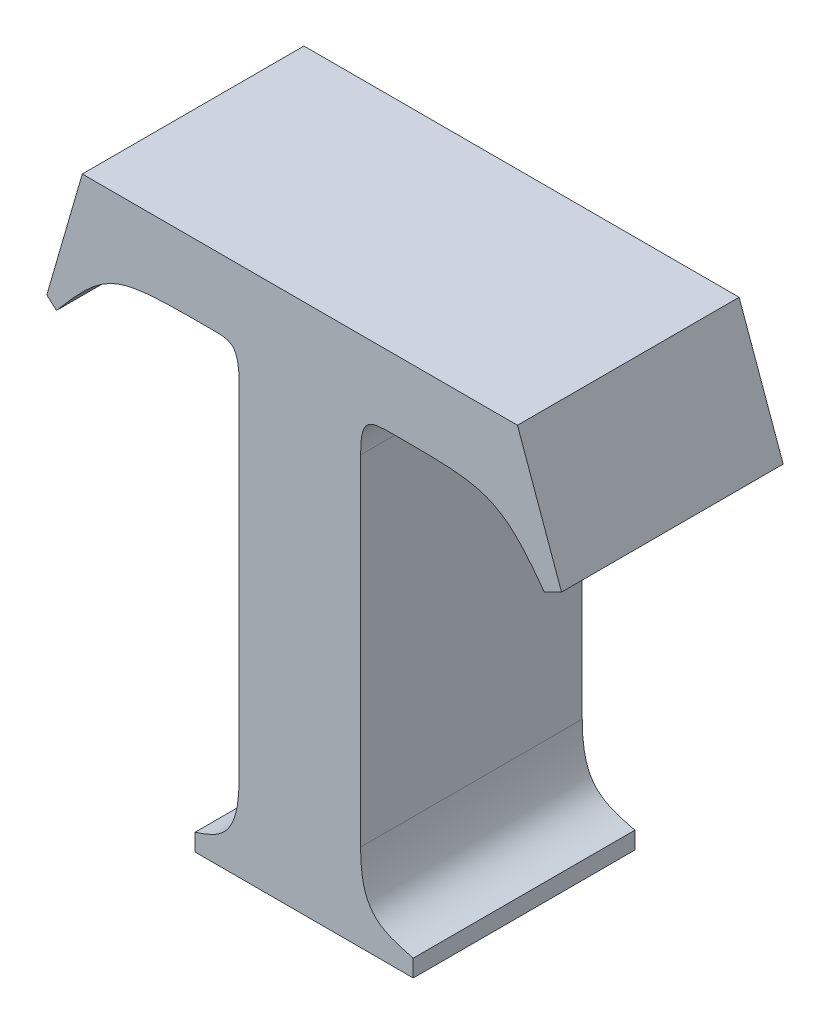
ISO-10303-21;
HEADER;
FILE_DESCRIPTION(('STEP AP214'),'2;1');
FILE_NAME('part.step','',(''),(''),'','','');
FILE_SCHEMA(('AUTOMOTIVE_DESIGN { 1 0 10303 214 1 1 1 1 }'));
ENDSEC;
DATA;
#1=APPLICATION_CONTEXT('core data for automotive mechanical design processes');
#2=APPLICATION_PROTOCOL_DEFINITION('international standard','automotive_design',2000,#1);
#3=PRODUCT_CONTEXT('',#1,'mechanical');
#4=PRODUCT('Part','Part','',(#3));
#5=PRODUCT_RELATED_PRODUCT_CATEGORY('part','',(#4));
#6=PRODUCT_DEFINITION_FORMATION('','',#4);
#7=PRODUCT_DEFINITION_CONTEXT('part definition',#1,'design');
#8=PRODUCT_DEFINITION('design','',#6,#7);
#9=PRODUCT_DEFINITION_SHAPE('','',#8);
#10=(LENGTH_UNIT() NAMED_UNIT(*) SI_UNIT(.MILLI.,.METRE.));
#11=(NAMED_UNIT(*) PLANE_ANGLE_UNIT() SI_UNIT($,.RADIAN.));
#12=(NAMED_UNIT(*) SI_UNIT($,.STERADIAN.) SOLID_ANGLE_UNIT());
#13=UNCERTAINTY_MEASURE_WITH_UNIT(LENGTH_MEASURE(1.E-05),#10,'distance_accuracy_value','');
#14=(GEOMETRIC_REPRESENTATION_CONTEXT(3) GLOBAL_UNCERTAINTY_ASSIGNED_CONTEXT((#13)) GLOBAL_UNIT_ASSIGNED_CONTEXT((#10,
#11,#12)) REPRESENTATION_CONTEXT('',''));
#15=CARTESIAN_POINT('',(0.,0.,0.));
#16=DIRECTION('',(0.,0.,1.));
#17=DIRECTION('',(1.,0.,0.));
#18=AXIS2_PLACEMENT_3D('',#15,#16,#17);
#19=CARTESIAN_POINT('',(4.4564512970043,-0.224083187566746,0.));
#20=CARTESIAN_POINT('',(4.4564512970043,-0.224083187566746,0.1));
#21=CARTESIAN_POINT('',(4.4957176924864,-0.224083187978514,0.));
#22=CARTESIAN_POINT('',(4.4957176924864,-0.224083187978514,0.1));
#23=CARTESIAN_POINT('',(4.5034738352268,-0.224083187862937,0.));
#24=CARTESIAN_POINT('',(4.5034738352268,-0.224083187862937,0.1));
#25=CARTESIAN_POINT('',(4.5233504151259,-0.251715261258299,0.));
#26=CARTESIAN_POINT('',(4.5233504151259,-0.251715261258299,0.1));
#27=B_SPLINE_SURFACE_WITH_KNOTS('',3,1,((#19,#20),(#21,#22),(#23,#24),(#25,#26)),.UNSPECIFIED.,
.F.,.F.,.F.,(4,4),(2,2),(-1.,0.),(0.,0.01),.UNSPECIFIED.);
#28=CARTESIAN_POINT('',(4.5233504151259,-0.251715261258299,0.));
#29=CARTESIAN_POINT('',(4.5034738352268,-0.224083187862937,0.));
#30=CARTESIAN_POINT('',(4.4957176924864,-0.224083187978514,0.));
#31=CARTESIAN_POINT('',(4.4564512970043,-0.224083187566746,0.));
#32=B_SPLINE_CURVE_WITH_KNOTS('',3,(#28,#29,#30,#31),.UNSPECIFIED.,.F.,.F.,(4,4),(0.,1.),.UNSPECIFIED.);
#33=CARTESIAN_POINT('',(4.5233504151259,-0.251715261258299,0.));
#34=VERTEX_POINT('',#33);
#35=CARTESIAN_POINT('',(4.4564512970043,-0.224083187566746,0.));
#36=VERTEX_POINT('',#35);
#37=EDGE_CURVE('E11',#34,#36,#32,.T.);
#38=DIRECTION('',(0.,0.,1.));
#39=VECTOR('',#38,1.);
#40=CARTESIAN_POINT('',(4.5233504151259,-0.251715261258299,0.));
#41=LINE('',#40,#39);
#42=CARTESIAN_POINT('',(4.5233504151259,-0.251715261258299,0.1));
#43=VERTEX_POINT('',#42);
#44=EDGE_CURVE('E28',#34,#43,#41,.T.);
#45=CARTESIAN_POINT('',(4.4564512970043,-0.224083187566746,0.1));
#46=CARTESIAN_POINT('',(4.4957176924864,-0.224083187978514,0.1));
#47=CARTESIAN_POINT('',(4.5034738352268,-0.224083187862937,0.1));
#48=CARTESIAN_POINT('',(4.5233504151259,-0.251715261258299,0.1));
#49=B_SPLINE_CURVE_WITH_KNOTS('',3,(#45,#46,#47,#48),.UNSPECIFIED.,.F.,.F.,(4,4),(-1.,0.),.UNSPECIFIED.);
#50=CARTESIAN_POINT('',(4.4564512970043,-0.224083187566746,0.1));
#51=VERTEX_POINT('',#50);
#52=EDGE_CURVE('E152',#51,#43,#49,.T.);
#53=DIRECTION('',(0.,0.,1.));
#54=VECTOR('',#53,1.);
#55=CARTESIAN_POINT('',(4.4564512970043,-0.224083187566746,0.));
#56=LINE('',#55,#54);
#57=EDGE_CURVE('E304',#36,#51,#56,.T.);
#58=ORIENTED_EDGE('',*,*,#37,.F.);
#59=ORIENTED_EDGE('',*,*,#44,.T.);
#60=ORIENTED_EDGE('',*,*,#52,.F.);
#61=ORIENTED_EDGE('',*,*,#57,.F.);
#62=EDGE_LOOP('',(#58,#59,#60,#61));
#63=FACE_BOUND('',#62,.T.);
#64=ADVANCED_FACE('F17',(#63),#27,.T.);
#65=CARTESIAN_POINT('',(4.440453689634,-0.23959597746735,0.));
#66=CARTESIAN_POINT('',(4.440453689634,-0.23959597746735,0.1));
#67=CARTESIAN_POINT('',(4.4404536896338,-0.224083187805134,0.));
#68=CARTESIAN_POINT('',(4.4404536896338,-0.224083187805134,0.1));
#69=CARTESIAN_POINT('',(4.4443323014532,-0.224083187747337,0.));
#70=CARTESIAN_POINT('',(4.4443323014532,-0.224083187747337,0.1));
#71=CARTESIAN_POINT('',(4.4564512970043,-0.224083187566746,0.));
#72=CARTESIAN_POINT('',(4.4564512970043,-0.224083187566746,0.1));
#73=B_SPLINE_SURFACE_WITH_KNOTS('',3,1,((#65,#66),(#67,#68),(#69,#70),(#71,#72)),.UNSPECIFIED.,
.F.,.F.,.F.,(4,4),(2,2),(-1.,0.),(0.,0.01),.UNSPECIFIED.);
#74=CARTESIAN_POINT('',(4.4564512970043,-0.224083187566746,0.));
#75=CARTESIAN_POINT('',(4.4443323014532,-0.224083187747337,0.));
#76=CARTESIAN_POINT('',(4.4404536896338,-0.224083187805134,0.));
#77=CARTESIAN_POINT('',(4.440453689634,-0.23959597746735,0.));
#78=B_SPLINE_CURVE_WITH_KNOTS('',3,(#74,#75,#76,#77),.UNSPECIFIED.,.F.,.F.,(4,4),(0.,1.),.UNSPECIFIED.);
#79=CARTESIAN_POINT('',(4.440453689634,-0.23959597746735,0.));
#80=VERTEX_POINT('',#79);
#81=EDGE_CURVE('E297',#36,#80,#78,.T.);
#82=CARTESIAN_POINT('',(4.440453689634,-0.23959597746735,0.1));
#83=CARTESIAN_POINT('',(4.4404536896338,-0.224083187805134,0.1));
#84=CARTESIAN_POINT('',(4.4443323014532,-0.224083187747337,0.1));
#85=CARTESIAN_POINT('',(4.4564512970043,-0.224083187566746,0.1));
#86=B_SPLINE_CURVE_WITH_KNOTS('',3,(#82,#83,#84,#85),.UNSPECIFIED.,.F.,.F.,(4,4),(-1.,0.),.UNSPECIFIED.);
#87=CARTESIAN_POINT('',(4.440453689634,-0.23959597746735,0.1));
#88=VERTEX_POINT('',#87);
#89=EDGE_CURVE('E293',#88,#51,#86,.T.);
#90=DIRECTION('',(0.,0.,1.));
#91=VECTOR('',#90,1.);
#92=CARTESIAN_POINT('',(4.440453689634,-0.23959597746735,0.));
#93=LINE('',#92,#91);
#94=EDGE_CURVE('E290',#80,#88,#93,.T.);
#95=ORIENTED_EDGE('',*,*,#81,.F.);
#96=ORIENTED_EDGE('',*,*,#57,.T.);
#97=ORIENTED_EDGE('',*,*,#89,.F.);
#98=ORIENTED_EDGE('',*,*,#94,.F.);
#99=EDGE_LOOP('',(#95,#96,#97,#98));
#100=FACE_BOUND('',#99,.T.);
#101=ADVANCED_FACE('F366',(#100),#73,.T.);
#102=CARTESIAN_POINT('',(4.440453689634,-0.392784138206144,0.));
#103=DIRECTION('',(1.,0.,0.));
#104=DIRECTION('',(0.,1.,0.));
#105=AXIS2_PLACEMENT_3D('',#102,#103,#104);
#106=PLANE('',#105);
#107=DIRECTION('',(0.,-1.,0.));
#108=VECTOR('',#107,1.);
#109=CARTESIAN_POINT('',(4.440453689634,-0.23959597746735,0.));
#110=LINE('',#109,#108);
#111=CARTESIAN_POINT('',(4.440453689634,-0.392784138206144,0.));
#112=VERTEX_POINT('',#111);
#113=EDGE_CURVE('E288',#80,#112,#110,.T.);
#114=ORIENTED_EDGE('',*,*,#113,.F.);
#115=ORIENTED_EDGE('',*,*,#94,.T.);
#116=DIRECTION('',(0.,1.,0.));
#117=VECTOR('',#116,1.);
#118=CARTESIAN_POINT('',(4.440453689634,-0.23959597746735,0.1));
#119=LINE('',#118,#117);
#120=CARTESIAN_POINT('',(4.440453689634,-0.392784138206144,0.1));
#121=VERTEX_POINT('',#120);
#122=EDGE_CURVE('E285',#121,#88,#119,.T.);
#123=ORIENTED_EDGE('',*,*,#122,.F.);
#124=DIRECTION('',(0.,0.,1.));
#125=VECTOR('',#124,1.);
#126=CARTESIAN_POINT('',(4.440453689634,-0.392784138206144,0.));
#127=LINE('',#126,#125);
#128=EDGE_CURVE('E279',#112,#121,#127,.T.);
#129=ORIENTED_EDGE('',*,*,#128,.F.);
#130=EDGE_LOOP('',(#114,#115,#123,#129));
#131=FACE_BOUND('',#130,.T.);
#132=ADVANCED_FACE('F362',(#131),#106,.T.);
#133=CARTESIAN_POINT('',(4.464207439746,-0.424294319298148,0.));
#134=CARTESIAN_POINT('',(4.464207439746,-0.424294319298148,0.1));
#135=CARTESIAN_POINT('',(4.4482098333695,-0.420416067498823,0.));
#136=CARTESIAN_POINT('',(4.4482098333695,-0.420416067498823,0.1));
#137=CARTESIAN_POINT('',(4.4404536904882,-0.416537924348319,0.));
#138=CARTESIAN_POINT('',(4.4404536904882,-0.416537924348319,0.1));
#139=CARTESIAN_POINT('',(4.440453689634,-0.392784138206144,0.));
#140=CARTESIAN_POINT('',(4.440453689634,-0.392784138206144,0.1));
#141=B_SPLINE_SURFACE_WITH_KNOTS('',3,1,((#133,#134),(#135,#136),(#137,#138),(#139,#140)),
.UNSPECIFIED.,.F.,.F.,.F.,(4,4),(2,2),(-1.,0.),(0.,0.01),.UNSPECIFIED.);
#142=CARTESIAN_POINT('',(4.440453689634,-0.392784138206144,0.));
#143=CARTESIAN_POINT('',(4.4404536904882,-0.416537924348319,0.));
#144=CARTESIAN_POINT('',(4.4482098333695,-0.420416067498823,0.));
#145=CARTESIAN_POINT('',(4.464207439746,-0.424294319298148,0.));
#146=B_SPLINE_CURVE_WITH_KNOTS('',3,(#142,#143,#144,#145),.UNSPECIFIED.,.F.,.F.,(4,4),(0.,1.),.UNSPECIFIED.);
#147=CARTESIAN_POINT('',(4.464207439746,-0.424294319298148,0.));
#148=VERTEX_POINT('',#147);
#149=EDGE_CURVE('E272',#112,#148,#146,.T.);
#150=CARTESIAN_POINT('',(4.464207439746,-0.424294319298148,0.1));
#151=CARTESIAN_POINT('',(4.4482098333695,-0.420416067498823,0.1));
#152=CARTESIAN_POINT('',(4.4404536904882,-0.416537924348319,0.1));
#153=CARTESIAN_POINT('',(4.440453689634,-0.392784138206144,0.1));
#154=B_SPLINE_CURVE_WITH_KNOTS('',3,(#150,#151,#152,#153),.UNSPECIFIED.,.F.,.F.,(4,4),(-1.,0.),.UNSPECIFIED.);
#155=CARTESIAN_POINT('',(4.464207439746,-0.424294319298148,0.1));
#156=VERTEX_POINT('',#155);
#157=EDGE_CURVE('E267',#156,#121,#154,.T.);
#158=DIRECTION('',(0.,0.,1.));
#159=VECTOR('',#158,1.);
#160=CARTESIAN_POINT('',(4.464207439746,-0.424294319298148,0.));
#161=LINE('',#160,#159);
#162=EDGE_CURVE('E264',#148,#156,#161,.T.);
#163=ORIENTED_EDGE('',*,*,#149,.F.);
#164=ORIENTED_EDGE('',*,*,#128,.T.);
#165=ORIENTED_EDGE('',*,*,#157,.F.);
#166=ORIENTED_EDGE('',*,*,#162,.F.);
#167=EDGE_LOOP('',(#163,#164,#165,#166));
#168=FACE_BOUND('',#167,.T.);
#169=ADVANCED_FACE('F358',(#168),#141,.T.);
#170=CARTESIAN_POINT('',(4.464207439746,-0.432050714249068,0.));
#171=DIRECTION('',(1.,0.,0.));
#172=DIRECTION('',(0.,1.,0.));
#173=AXIS2_PLACEMENT_3D('',#170,#171,#172);
#174=PLANE('',#173);
#175=DIRECTION('',(0.,-1.,0.));
#176=VECTOR('',#175,1.);
#177=CARTESIAN_POINT('',(4.464207439746,-0.424294319298148,0.));
#178=LINE('',#177,#176);
#179=CARTESIAN_POINT('',(4.464207439746,-0.432050714249068,0.));
#180=VERTEX_POINT('',#179);
#181=EDGE_CURVE('E262',#148,#180,#178,.T.);
#182=ORIENTED_EDGE('',*,*,#181,.F.);
#183=ORIENTED_EDGE('',*,*,#162,.T.);
#184=DIRECTION('',(0.,1.,0.));
#185=VECTOR('',#184,1.);
#186=CARTESIAN_POINT('',(4.464207439746,-0.424294319298148,0.1));
#187=LINE('',#186,#185);
#188=CARTESIAN_POINT('',(4.464207439746,-0.432050714249068,0.1));
#189=VERTEX_POINT('',#188);
#190=EDGE_CURVE('E259',#189,#156,#187,.T.);
#191=ORIENTED_EDGE('',*,*,#190,.F.);
#192=DIRECTION('',(0.,0.,1.));
#193=VECTOR('',#192,1.);
#194=CARTESIAN_POINT('',(4.464207439746,-0.432050714249068,0.));
#195=LINE('',#194,#193);
#196=EDGE_CURVE('E256',#180,#189,#195,.T.);
#197=ORIENTED_EDGE('',*,*,#196,.F.);
#198=EDGE_LOOP('',(#182,#183,#191,#197));
#199=FACE_BOUND('',#198,.T.);
#200=ADVANCED_FACE('F354',(#199),#174,.T.);
#201=CARTESIAN_POINT('',(4.3657995096659,-0.432050714249068,0.));
#202=DIRECTION('',(0.,-1.,0.));
#203=DIRECTION('',(1.,0.,0.));
#204=AXIS2_PLACEMENT_3D('',#201,#202,#203);
#205=PLANE('',#204);
#206=DIRECTION('',(-1.,0.,0.));
#207=VECTOR('',#206,1.);
#208=CARTESIAN_POINT('',(4.464207439746,-0.432050714249068,0.));
#209=LINE('',#208,#207);
#210=CARTESIAN_POINT('',(4.3657995096659,-0.432050714249068,0.));
#211=VERTEX_POINT('',#210);
#212=EDGE_CURVE('E254',#180,#211,#209,.T.);
#213=ORIENTED_EDGE('',*,*,#212,.F.);
#214=ORIENTED_EDGE('',*,*,#196,.T.);
#215=DIRECTION('',(1.,0.,0.));
#216=VECTOR('',#215,1.);
#217=CARTESIAN_POINT('',(4.464207439746,-0.432050714249068,0.1));
#218=LINE('',#217,#216);
#219=CARTESIAN_POINT('',(4.3657995096659,-0.432050714249068,0.1));
#220=VERTEX_POINT('',#219);
#221=EDGE_CURVE('E251',#220,#189,#218,.T.);
#222=ORIENTED_EDGE('',*,*,#221,.F.);
#223=DIRECTION('',(0.,0.,1.));
#224=VECTOR('',#223,1.);
#225=CARTESIAN_POINT('',(4.3657995096659,-0.432050714249068,0.));
#226=LINE('',#225,#224);
#227=EDGE_CURVE('E248',#211,#220,#226,.T.);
#228=ORIENTED_EDGE('',*,*,#227,.F.);
#229=EDGE_LOOP('',(#213,#214,#222,#228));
#230=FACE_BOUND('',#229,.T.);
#231=ADVANCED_FACE('F350',(#230),#205,.T.);
#232=CARTESIAN_POINT('',(4.3657995096659,-0.424294319298148,0.));
#233=DIRECTION('',(-1.,0.,0.));
#234=DIRECTION('',(0.,-1.,0.));
#235=AXIS2_PLACEMENT_3D('',#232,#233,#234);
#236=PLANE('',#235);
#237=DIRECTION('',(0.,1.,0.));
#238=VECTOR('',#237,1.);
#239=CARTESIAN_POINT('',(4.3657995096659,-0.432050714249068,0.));
#240=LINE('',#239,#238);
#241=CARTESIAN_POINT('',(4.3657995096659,-0.424294319298148,0.));
#242=VERTEX_POINT('',#241);
#243=EDGE_CURVE('E246',#211,#242,#240,.T.);
#244=ORIENTED_EDGE('',*,*,#243,.F.);
#245=ORIENTED_EDGE('',*,*,#227,.T.);
#246=DIRECTION('',(0.,-1.,0.));
#247=VECTOR('',#246,1.);
#248=CARTESIAN_POINT('',(4.3657995096659,-0.432050714249068,0.1));
#249=LINE('',#248,#247);
#250=CARTESIAN_POINT('',(4.3657995096659,-0.424294319298148,0.1));
#251=VERTEX_POINT('',#250);
#252=EDGE_CURVE('E243',#251,#220,#249,.T.);
#253=ORIENTED_EDGE('',*,*,#252,.F.);
#254=DIRECTION('',(0.,0.,1.));
#255=VECTOR('',#254,1.);
#256=CARTESIAN_POINT('',(4.3657995096659,-0.424294319298148,0.));
#257=LINE('',#256,#255);
#258=EDGE_CURVE('E237',#242,#251,#257,.T.);
#259=ORIENTED_EDGE('',*,*,#258,.F.);
#260=EDGE_LOOP('',(#244,#245,#253,#259));
#261=FACE_BOUND('',#260,.T.);
#262=ADVANCED_FACE('F346',(#261),#236,.T.);
#263=CARTESIAN_POINT('',(4.3856746479601,-0.392784138206144,0.));
#264=CARTESIAN_POINT('',(4.3856746479601,-0.392784138206144,0.1));
#265=CARTESIAN_POINT('',(4.3856746477971,-0.416537923929483,0.));
#266=CARTESIAN_POINT('',(4.3856746477971,-0.416537923929483,0.1));
#267=CARTESIAN_POINT('',(4.3779185051364,-0.420416067522484,0.));
#268=CARTESIAN_POINT('',(4.3779185051364,-0.420416067522484,0.1));
#269=CARTESIAN_POINT('',(4.3657995096659,-0.424294319298148,0.));
#270=CARTESIAN_POINT('',(4.3657995096659,-0.424294319298148,0.1));
#271=B_SPLINE_SURFACE_WITH_KNOTS('',3,1,((#263,#264),(#265,#266),(#267,#268),(#269,#270)),
.UNSPECIFIED.,.F.,.F.,.F.,(4,4),(2,2),(-1.,0.),(0.,0.01),.UNSPECIFIED.);
#272=CARTESIAN_POINT('',(4.3657995096659,-0.424294319298148,0.));
#273=CARTESIAN_POINT('',(4.3779185051364,-0.420416067522484,0.));
#274=CARTESIAN_POINT('',(4.3856746477971,-0.416537923929483,0.));
#275=CARTESIAN_POINT('',(4.3856746479601,-0.392784138206144,0.));
#276=B_SPLINE_CURVE_WITH_KNOTS('',3,(#272,#273,#274,#275),.UNSPECIFIED.,.F.,.F.,(4,4),(0.,1.),.UNSPECIFIED.);
#277=CARTESIAN_POINT('',(4.3856746479601,-0.392784138206144,0.));
#278=VERTEX_POINT('',#277);
#279=EDGE_CURVE('E230',#242,#278,#276,.T.);
#280=CARTESIAN_POINT('',(4.3856746479601,-0.392784138206144,0.1));
#281=CARTESIAN_POINT('',(4.3856746477971,-0.416537923929483,0.1));
#282=CARTESIAN_POINT('',(4.3779185051364,-0.420416067522484,0.1));
#283=CARTESIAN_POINT('',(4.3657995096659,-0.424294319298148,0.1));
#284=B_SPLINE_CURVE_WITH_KNOTS('',3,(#280,#281,#282,#283),.UNSPECIFIED.,.F.,.F.,(4,4),(-1.,0.),.UNSPECIFIED.);
#285=CARTESIAN_POINT('',(4.3856746479601,-0.392784138206144,0.1));
#286=VERTEX_POINT('',#285);
#287=EDGE_CURVE('E225',#286,#251,#284,.T.);
#288=DIRECTION('',(0.,0.,1.));
#289=VECTOR('',#288,1.);
#290=CARTESIAN_POINT('',(4.3856746479601,-0.392784138206144,0.));
#291=LINE('',#290,#289);
#292=EDGE_CURVE('E222',#278,#286,#291,.T.);
#293=ORIENTED_EDGE('',*,*,#279,.F.);
#294=ORIENTED_EDGE('',*,*,#258,.T.);
#295=ORIENTED_EDGE('',*,*,#287,.F.);
#296=ORIENTED_EDGE('',*,*,#292,.F.);
#297=EDGE_LOOP('',(#293,#294,#295,#296));
#298=FACE_BOUND('',#297,.T.);
#299=ADVANCED_FACE('F342',(#298),#271,.T.);
#300=CARTESIAN_POINT('',(4.3856746479601,-0.23959597746735,0.));
#301=DIRECTION('',(-1.,0.,0.));
#302=DIRECTION('',(0.,-1.,0.));
#303=AXIS2_PLACEMENT_3D('',#300,#301,#302);
#304=PLANE('',#303);
#305=DIRECTION('',(0.,1.,0.));
#306=VECTOR('',#305,1.);
#307=CARTESIAN_POINT('',(4.3856746479601,-0.392784138206144,0.));
#308=LINE('',#307,#306);
#309=CARTESIAN_POINT('',(4.3856746479601,-0.23959597746735,0.));
#310=VERTEX_POINT('',#309);
#311=EDGE_CURVE('E220',#278,#310,#308,.T.);
#312=ORIENTED_EDGE('',*,*,#311,.F.);
#313=ORIENTED_EDGE('',*,*,#292,.T.);
#314=DIRECTION('',(0.,-1.,0.));
#315=VECTOR('',#314,1.);
#316=CARTESIAN_POINT('',(4.3856746479601,-0.392784138206144,0.1));
#317=LINE('',#316,#315);
#318=CARTESIAN_POINT('',(4.3856746479601,-0.23959597746735,0.1));
#319=VERTEX_POINT('',#318);
#320=EDGE_CURVE('E217',#319,#286,#317,.T.);
#321=ORIENTED_EDGE('',*,*,#320,.F.);
#322=DIRECTION('',(0.,0.,1.));
#323=VECTOR('',#322,1.);
#324=CARTESIAN_POINT('',(4.3856746479601,-0.23959597746735,0.));
#325=LINE('',#324,#323);
#326=EDGE_CURVE('E211',#310,#319,#325,.T.);
#327=ORIENTED_EDGE('',*,*,#326,.F.);
#328=EDGE_LOOP('',(#312,#313,#321,#327));
#329=FACE_BOUND('',#328,.T.);
#330=ADVANCED_FACE('F338',(#329),#304,.T.);
#331=CARTESIAN_POINT('',(4.3735556524076,-0.224083187566746,0.));
#332=CARTESIAN_POINT('',(4.3735556524076,-0.224083187566746,0.1));
#333=CARTESIAN_POINT('',(4.3817971171316,-0.224083187542844,0.));
#334=CARTESIAN_POINT('',(4.3817971171316,-0.224083187542844,0.1));
#335=CARTESIAN_POINT('',(4.3856746480555,-0.224083187566758,0.));
#336=CARTESIAN_POINT('',(4.3856746480555,-0.224083187566758,0.1));
#337=CARTESIAN_POINT('',(4.3856746479601,-0.23959597746735,0.));
#338=CARTESIAN_POINT('',(4.3856746479601,-0.23959597746735,0.1));
#339=B_SPLINE_SURFACE_WITH_KNOTS('',3,1,((#331,#332),(#333,#334),(#335,#336),(#337,#338)),
.UNSPECIFIED.,.F.,.F.,.F.,(4,4),(2,2),(-1.,0.),(0.,0.01),.UNSPECIFIED.);
#340=CARTESIAN_POINT('',(4.3856746479601,-0.23959597746735,0.));
#341=CARTESIAN_POINT('',(4.3856746480555,-0.224083187566758,0.));
#342=CARTESIAN_POINT('',(4.3817971171316,-0.224083187542844,0.));
#343=CARTESIAN_POINT('',(4.3735556524076,-0.224083187566746,0.));
#344=B_SPLINE_CURVE_WITH_KNOTS('',3,(#340,#341,#342,#343),.UNSPECIFIED.,.F.,.F.,(4,4),(0.,1.),.UNSPECIFIED.);
#345=CARTESIAN_POINT('',(4.3735556524076,-0.224083187566746,0.));
#346=VERTEX_POINT('',#345);
#347=EDGE_CURVE('E204',#310,#346,#344,.T.);
#348=CARTESIAN_POINT('',(4.3735556524076,-0.224083187566746,0.1));
#349=CARTESIAN_POINT('',(4.3817971171316,-0.224083187542844,0.1));
#350=CARTESIAN_POINT('',(4.3856746480555,-0.224083187566758,0.1));
#351=CARTESIAN_POINT('',(4.3856746479601,-0.23959597746735,0.1));
#352=B_SPLINE_CURVE_WITH_KNOTS('',3,(#348,#349,#350,#351),.UNSPECIFIED.,.F.,.F.,(4,4),(-1.,0.),.UNSPECIFIED.);
#353=CARTESIAN_POINT('',(4.3735556524076,-0.224083187566746,0.1));
#354=VERTEX_POINT('',#353);
#355=EDGE_CURVE('E199',#354,#319,#352,.T.);
#356=DIRECTION('',(0.,0.,1.));
#357=VECTOR('',#356,1.);
#358=CARTESIAN_POINT('',(4.3735556524076,-0.224083187566746,0.));
#359=LINE('',#358,#357);
#360=EDGE_CURVE('E193',#346,#354,#359,.T.);
#361=ORIENTED_EDGE('',*,*,#347,.F.);
#362=ORIENTED_EDGE('',*,*,#326,.T.);
#363=ORIENTED_EDGE('',*,*,#355,.F.);
#364=ORIENTED_EDGE('',*,*,#360,.F.);
#365=EDGE_LOOP('',(#361,#362,#363,#364));
#366=FACE_BOUND('',#365,.T.);
#367=ADVANCED_FACE('F334',(#366),#339,.T.);
#368=CARTESIAN_POINT('',(4.3032628840575,-0.251715261258299,0.));
#369=CARTESIAN_POINT('',(4.3032628840575,-0.251715261258299,0.1));
#370=CARTESIAN_POINT('',(4.326533113773,-0.22408318954861,0.));
#371=CARTESIAN_POINT('',(4.326533113773,-0.22408318954861,0.1));
#372=CARTESIAN_POINT('',(4.3304106446969,-0.224083189385182,0.));
#373=CARTESIAN_POINT('',(4.3304106446969,-0.224083189385182,0.1));
#374=CARTESIAN_POINT('',(4.3735556524076,-0.224083187566746,0.));
#375=CARTESIAN_POINT('',(4.3735556524076,-0.224083187566746,0.1));
#376=B_SPLINE_SURFACE_WITH_KNOTS('',3,1,((#368,#369),(#370,#371),(#372,#373),(#374,#375)),
.UNSPECIFIED.,.F.,.F.,.F.,(4,4),(2,2),(-1.,0.),(0.,0.01),.UNSPECIFIED.);
#377=CARTESIAN_POINT('',(4.3735556524076,-0.224083187566746,0.));
#378=CARTESIAN_POINT('',(4.3304106446969,-0.224083189385182,0.));
#379=CARTESIAN_POINT('',(4.326533113773,-0.22408318954861,0.));
#380=CARTESIAN_POINT('',(4.3032628840575,-0.251715261258299,0.));
#381=B_SPLINE_CURVE_WITH_KNOTS('',3,(#377,#378,#379,#380),.UNSPECIFIED.,.F.,.F.,(4,4),(0.,1.),.UNSPECIFIED.);
#382=CARTESIAN_POINT('',(4.3032628840575,-0.251715261258299,0.));
#383=VERTEX_POINT('',#382);
#384=EDGE_CURVE('E186',#346,#383,#381,.T.);
#385=CARTESIAN_POINT('',(4.3032628840575,-0.251715261258299,0.1));
#386=CARTESIAN_POINT('',(4.326533113773,-0.22408318954861,0.1));
#387=CARTESIAN_POINT('',(4.3304106446969,-0.224083189385182,0.1));
#388=CARTESIAN_POINT('',(4.3735556524076,-0.224083187566746,0.1));
#389=B_SPLINE_CURVE_WITH_KNOTS('',3,(#385,#386,#387,#388),.UNSPECIFIED.,.F.,.F.,(4,4),(-1.,0.),.UNSPECIFIED.);
#390=CARTESIAN_POINT('',(4.3032628840575,-0.251715261258299,0.1));
#391=VERTEX_POINT('',#390);
#392=EDGE_CURVE('E181',#391,#354,#389,.T.);
#393=DIRECTION('',(0.,0.,1.));
#394=VECTOR('',#393,1.);
#395=CARTESIAN_POINT('',(4.3032628840575,-0.251715261258299,0.));
#396=LINE('',#395,#394);
#397=EDGE_CURVE('E178',#383,#391,#396,.T.);
#398=ORIENTED_EDGE('',*,*,#384,.F.);
#399=ORIENTED_EDGE('',*,*,#360,.T.);
#400=ORIENTED_EDGE('',*,*,#392,.F.);
#401=ORIENTED_EDGE('',*,*,#397,.F.);
#402=EDGE_LOOP('',(#398,#399,#400,#401));
#403=FACE_BOUND('',#402,.T.);
#404=ADVANCED_FACE('F330',(#403),#376,.T.);
#405=CARTESIAN_POINT('',(4.2989003915443,-0.247837117827599,0.));
#406=DIRECTION('',(-0.664399468795114,-0.747377646083137,0.));
#407=DIRECTION('',(0.747377646083137,-0.664399468795114,0.));
#408=AXIS2_PLACEMENT_3D('',#405,#406,#407);
#409=PLANE('',#408);
#410=DIRECTION('',(-0.747377646083137,0.664399468795114,0.));
#411=VECTOR('',#410,1.);
#412=CARTESIAN_POINT('',(4.3032628840575,-0.251715261258299,0.));
#413=LINE('',#412,#411);
#414=CARTESIAN_POINT('',(4.2989003915443,-0.247837117827599,0.));
#415=VERTEX_POINT('',#414);
#416=EDGE_CURVE('E176',#383,#415,#413,.T.);
#417=ORIENTED_EDGE('',*,*,#416,.F.);
#418=ORIENTED_EDGE('',*,*,#397,.T.);
#419=DIRECTION('',(0.747377646083137,-0.664399468795114,0.));
#420=VECTOR('',#419,1.);
#421=CARTESIAN_POINT('',(4.3032628840575,-0.251715261258299,0.1));
#422=LINE('',#421,#420);
#423=CARTESIAN_POINT('',(4.2989003915443,-0.247837117827599,0.1));
#424=VERTEX_POINT('',#423);
#425=EDGE_CURVE('E173',#424,#391,#422,.T.);
#426=ORIENTED_EDGE('',*,*,#425,.F.);
#427=DIRECTION('',(0.,0.,1.));
#428=VECTOR('',#427,1.);
#429=CARTESIAN_POINT('',(4.2989003915443,-0.247837117827599,0.));
#430=LINE('',#429,#428);
#431=EDGE_CURVE('E170',#415,#424,#430,.T.);
#432=ORIENTED_EDGE('',*,*,#431,.F.);
#433=EDGE_LOOP('',(#417,#418,#426,#432));
#434=FACE_BOUND('',#433,.T.);
#435=ADVANCED_FACE('F326',(#434),#409,.T.);
#436=CARTESIAN_POINT('',(4.3148979989147,-0.19257300647474,0.));
#437=DIRECTION('',(-0.960563793427833,0.27805970358096,0.));
#438=DIRECTION('',(-0.27805970358096,-0.960563793427833,0.));
#439=AXIS2_PLACEMENT_3D('',#436,#437,#438);
#440=PLANE('',#439);
#441=DIRECTION('',(0.27805970358096,0.960563793427833,0.));
#442=VECTOR('',#441,1.);
#443=CARTESIAN_POINT('',(4.2989003915443,-0.247837117827599,0.));
#444=LINE('',#443,#442);
#445=CARTESIAN_POINT('',(4.3148979989147,-0.19257300647474,0.));
#446=VERTEX_POINT('',#445);
#447=EDGE_CURVE('E168',#415,#446,#444,.T.);
#448=ORIENTED_EDGE('',*,*,#447,.F.);
#449=ORIENTED_EDGE('',*,*,#431,.T.);
#450=DIRECTION('',(-0.27805970358096,-0.960563793427833,0.));
#451=VECTOR('',#450,1.);
#452=CARTESIAN_POINT('',(4.2989003915443,-0.247837117827599,0.1));
#453=LINE('',#452,#451);
#454=CARTESIAN_POINT('',(4.3148979989147,-0.19257300647474,0.1));
#455=VERTEX_POINT('',#454);
#456=EDGE_CURVE('E165',#455,#424,#453,.T.);
#457=ORIENTED_EDGE('',*,*,#456,.F.);
#458=DIRECTION('',(0.,0.,1.));
#459=VECTOR('',#458,1.);
#460=CARTESIAN_POINT('',(4.3148979989147,-0.19257300647474,0.));
#461=LINE('',#460,#459);
#462=EDGE_CURVE('E162',#446,#455,#461,.T.);
#463=ORIENTED_EDGE('',*,*,#462,.F.);
#464=EDGE_LOOP('',(#448,#449,#457,#463));
#465=FACE_BOUND('',#464,.T.);
#466=ADVANCED_FACE('F322',(#465),#440,.T.);
#467=CARTESIAN_POINT('',(4.5112314195746,-0.19257300647474,0.));
#468=DIRECTION('',(0.,1.,0.));
#469=DIRECTION('',(-1.,0.,0.));
#470=AXIS2_PLACEMENT_3D('',#467,#468,#469);
#471=PLANE('',#470);
#472=DIRECTION('',(1.,0.,0.));
#473=VECTOR('',#472,1.);
#474=CARTESIAN_POINT('',(4.3148979989147,-0.19257300647474,0.));
#475=LINE('',#474,#473);
#476=CARTESIAN_POINT('',(4.5112314195746,-0.19257300647474,0.));
#477=VERTEX_POINT('',#476);
#478=EDGE_CURVE('E160',#446,#477,#475,.T.);
#479=ORIENTED_EDGE('',*,*,#478,.F.);
#480=ORIENTED_EDGE('',*,*,#462,.T.);
#481=DIRECTION('',(-1.,0.,0.));
#482=VECTOR('',#481,1.);
#483=CARTESIAN_POINT('',(4.3148979989147,-0.19257300647474,0.1));
#484=LINE('',#483,#482);
#485=CARTESIAN_POINT('',(4.5112314195746,-0.19257300647474,0.1));
#486=VERTEX_POINT('',#485);
#487=EDGE_CURVE('E158',#486,#455,#484,.T.);
#488=ORIENTED_EDGE('',*,*,#487,.F.);
#489=DIRECTION('',(0.,0.,1.));
#490=VECTOR('',#489,1.);
#491=CARTESIAN_POINT('',(4.5112314195746,-0.19257300647474,0.));
#492=LINE('',#491,#490);
#493=EDGE_CURVE('E137',#477,#486,#492,.T.);
#494=ORIENTED_EDGE('',*,*,#493,.F.);
#495=EDGE_LOOP('',(#479,#480,#488,#494));
#496=FACE_BOUND('',#495,.T.);
#497=ADVANCED_FACE('F320',(#496),#471,.T.);
#498=CARTESIAN_POINT('',(4.5311065578676,-0.247837117827599,0.));
#499=DIRECTION('',(0.940995578594813,0.338418854476245,0.));
#500=DIRECTION('',(-0.338418854476245,0.940995578594813,0.));
#501=AXIS2_PLACEMENT_3D('',#498,#499,#500);
#502=PLANE('',#501);
#503=DIRECTION('',(0.338418854476245,-0.940995578594813,0.));
#504=VECTOR('',#503,1.);
#505=CARTESIAN_POINT('',(4.5112314195746,-0.19257300647474,0.));
#506=LINE('',#505,#504);
#507=CARTESIAN_POINT('',(4.5311065578676,-0.247837117827599,0.));
#508=VERTEX_POINT('',#507);
#509=EDGE_CURVE('E141',#477,#508,#506,.T.);
#510=ORIENTED_EDGE('',*,*,#509,.F.);
#511=ORIENTED_EDGE('',*,*,#493,.T.);
#512=DIRECTION('',(-0.338418854476245,0.940995578594813,0.));
#513=VECTOR('',#512,1.);
#514=CARTESIAN_POINT('',(4.5112314195746,-0.19257300647474,0.1));
#515=LINE('',#514,#513);
#516=CARTESIAN_POINT('',(4.5311065578676,-0.247837117827599,0.1));
#517=VERTEX_POINT('',#516);
#518=EDGE_CURVE('E130',#517,#486,#515,.T.);
#519=ORIENTED_EDGE('',*,*,#518,.F.);
#520=DIRECTION('',(0.,0.,1.));
#521=VECTOR('',#520,1.);
#522=CARTESIAN_POINT('',(4.5311065578676,-0.247837117827599,0.));
#523=LINE('',#522,#521);
#524=EDGE_CURVE('E134',#508,#517,#523,.T.);
#525=ORIENTED_EDGE('',*,*,#524,.F.);
#526=EDGE_LOOP('',(#510,#511,#519,#525));
#527=FACE_BOUND('',#526,.T.);
#528=ADVANCED_FACE('F133',(#527),#502,.T.);
#529=CARTESIAN_POINT('',(4.5233504151259,-0.251715261258299,0.));
#530=DIRECTION('',(0.447220243335393,-0.894423867051317,0.));
#531=DIRECTION('',(0.894423867051317,0.447220243335393,0.));
#532=AXIS2_PLACEMENT_3D('',#529,#530,#531);
#533=PLANE('',#532);
#534=DIRECTION('',(-0.894423867051317,-0.447220243335393,0.));
#535=VECTOR('',#534,1.);
#536=CARTESIAN_POINT('',(4.5311065578676,-0.247837117827599,0.));
#537=LINE('',#536,#535);
#538=EDGE_CURVE('E147',#508,#34,#537,.T.);
#539=ORIENTED_EDGE('',*,*,#538,.F.);
#540=ORIENTED_EDGE('',*,*,#524,.T.);
#541=DIRECTION('',(0.894423867051317,0.447220243335393,0.));
#542=VECTOR('',#541,1.);
#543=CARTESIAN_POINT('',(4.5311065578676,-0.247837117827599,0.1));
#544=LINE('',#543,#542);
#545=EDGE_CURVE('E146',#43,#517,#544,.T.);
#546=ORIENTED_EDGE('',*,*,#545,.F.);
#547=ORIENTED_EDGE('',*,*,#44,.F.);
#548=EDGE_LOOP('',(#539,#540,#546,#547));
#549=FACE_BOUND('',#548,.T.);
#550=ADVANCED_FACE('F145',(#549),#533,.T.);
#551=CARTESIAN_POINT('',(4.4141115687513,-0.284683378161262,0.));
#552=DIRECTION('',(0.,0.,1.));
#553=DIRECTION('',(1.,0.,0.));
#554=AXIS2_PLACEMENT_3D('',#551,#552,#553);
#555=PLANE('',#554);
#556=ORIENTED_EDGE('',*,*,#538,.T.);
#557=ORIENTED_EDGE('',*,*,#37,.T.);
#558=ORIENTED_EDGE('',*,*,#81,.T.);
#559=ORIENTED_EDGE('',*,*,#113,.T.);
#560=ORIENTED_EDGE('',*,*,#149,.T.);
#561=ORIENTED_EDGE('',*,*,#181,.T.);
#562=ORIENTED_EDGE('',*,*,#212,.T.);
#563=ORIENTED_EDGE('',*,*,#243,.T.);
#564=ORIENTED_EDGE('',*,*,#279,.T.);
#565=ORIENTED_EDGE('',*,*,#311,.T.);
#566=ORIENTED_EDGE('',*,*,#347,.T.);
#567=ORIENTED_EDGE('',*,*,#384,.T.);
#568=ORIENTED_EDGE('',*,*,#416,.T.);
#569=ORIENTED_EDGE('',*,*,#447,.T.);
#570=ORIENTED_EDGE('',*,*,#478,.T.);
#571=ORIENTED_EDGE('',*,*,#509,.T.);
#572=EDGE_LOOP('',(#556,#557,#558,#559,#560,#561,#562,#563,#564,#565,#566,#567,#568,#569,#570,#571));
#573=FACE_BOUND('',#572,.T.);
#574=ADVANCED_FACE('F315',(#573),#555,.F.);
#575=CARTESIAN_POINT('',(4.4141115687513,-0.284683378161262,0.1));
#576=DIRECTION('',(0.,0.,1.));
#577=DIRECTION('',(1.,0.,0.));
#578=AXIS2_PLACEMENT_3D('',#575,#576,#577);
#579=PLANE('',#578);
#580=ORIENTED_EDGE('',*,*,#545,.T.);
#581=ORIENTED_EDGE('',*,*,#518,.T.);
#582=ORIENTED_EDGE('',*,*,#487,.T.);
#583=ORIENTED_EDGE('',*,*,#456,.T.);
#584=ORIENTED_EDGE('',*,*,#425,.T.);
#585=ORIENTED_EDGE('',*,*,#392,.T.);
#586=ORIENTED_EDGE('',*,*,#355,.T.);
#587=ORIENTED_EDGE('',*,*,#320,.T.);
#588=ORIENTED_EDGE('',*,*,#287,.T.);
#589=ORIENTED_EDGE('',*,*,#252,.T.);
#590=ORIENTED_EDGE('',*,*,#221,.T.);
#591=ORIENTED_EDGE('',*,*,#190,.T.);
#592=ORIENTED_EDGE('',*,*,#157,.T.);
#593=ORIENTED_EDGE('',*,*,#122,.T.);
#594=ORIENTED_EDGE('',*,*,#89,.T.);
#595=ORIENTED_EDGE('',*,*,#52,.T.);
#596=EDGE_LOOP('',(#580,#581,#582,#583,#584,#585,#586,#587,#588,#589,#590,#591,#592,#593,#594,#595));
#597=FACE_BOUND('',#596,.T.);
#598=ADVANCED_FACE('F150',(#597),#579,.T.);
#599=CLOSED_SHELL('',(#64,#101,#132,#169,#200,#231,#262,#299,#330,#367,#404,#435,#466,#497,#528,
#550,#574,#598));
#600=MANIFOLD_SOLID_BREP('B1',#599);
#601=ADVANCED_BREP_SHAPE_REPRESENTATION('',(#18,#600),#14);
#602=SHAPE_DEFINITION_REPRESENTATION(#9,#601);
ENDSEC;
END-ISO-10303-21;
